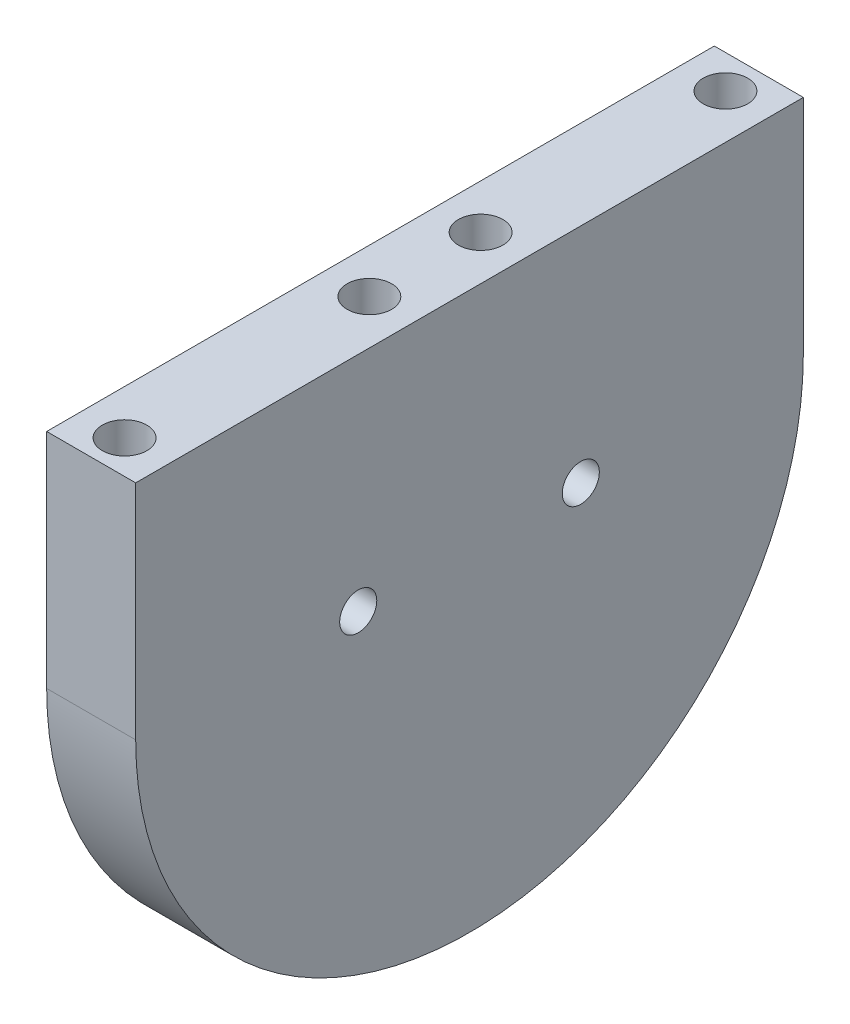
ISO-10303-21;
HEADER;
FILE_DESCRIPTION(('STEP AP214'),'2;1');
FILE_NAME('part.step','',(''),(''),'','','');
FILE_SCHEMA(('AUTOMOTIVE_DESIGN { 1 0 10303 214 1 1 1 1 }'));
ENDSEC;
DATA;
#1=APPLICATION_CONTEXT('core data for automotive mechanical design processes');
#2=APPLICATION_PROTOCOL_DEFINITION('international standard','automotive_design',2000,#1);
#3=PRODUCT_CONTEXT('',#1,'mechanical');
#4=PRODUCT('Part','Part','',(#3));
#5=PRODUCT_RELATED_PRODUCT_CATEGORY('part','',(#4));
#6=PRODUCT_DEFINITION_FORMATION('','',#4);
#7=PRODUCT_DEFINITION_CONTEXT('part definition',#1,'design');
#8=PRODUCT_DEFINITION('design','',#6,#7);
#9=PRODUCT_DEFINITION_SHAPE('','',#8);
#10=(LENGTH_UNIT() NAMED_UNIT(*) SI_UNIT(.MILLI.,.METRE.));
#11=(NAMED_UNIT(*) PLANE_ANGLE_UNIT() SI_UNIT($,.RADIAN.));
#12=(NAMED_UNIT(*) SI_UNIT($,.STERADIAN.) SOLID_ANGLE_UNIT());
#13=UNCERTAINTY_MEASURE_WITH_UNIT(LENGTH_MEASURE(1.E-05),#10,'distance_accuracy_value','');
#14=(GEOMETRIC_REPRESENTATION_CONTEXT(3) GLOBAL_UNCERTAINTY_ASSIGNED_CONTEXT((#13)) GLOBAL_UNIT_ASSIGNED_CONTEXT((#10,
#11,#12)) REPRESENTATION_CONTEXT('',''));
#15=CARTESIAN_POINT('',(0.,0.,0.));
#16=DIRECTION('',(0.,0.,1.));
#17=DIRECTION('',(1.,0.,0.));
#18=AXIS2_PLACEMENT_3D('',#15,#16,#17);
#19=CARTESIAN_POINT('',(12.,0.,0.));
#20=DIRECTION('',(1.,0.,0.));
#21=DIRECTION('',(0.,0.,-1.));
#22=AXIS2_PLACEMENT_3D('',#19,#20,#21);
#23=PLANE('',#22);
#24=CARTESIAN_POINT('',(12.,0.,15.));
#25=DIRECTION('',(1.,0.,0.));
#26=DIRECTION('',(0.,0.,-1.));
#27=AXIS2_PLACEMENT_3D('',#24,#25,#26);
#28=CIRCLE('',#27,2.5);
#29=CARTESIAN_POINT('',(12.,0.,12.5));
#30=VERTEX_POINT('',#29);
#31=EDGE_CURVE('E104',#30,#30,#28,.T.);
#32=ORIENTED_EDGE('',*,*,#31,.F.);
#33=EDGE_LOOP('',(#32));
#34=FACE_BOUND('',#33,.T.);
#35=CARTESIAN_POINT('',(12.,0.,0.));
#36=DIRECTION('',(1.,0.,0.));
#37=DIRECTION('',(0.,0.,-1.));
#38=AXIS2_PLACEMENT_3D('',#35,#36,#37);
#39=CIRCLE('',#38,45.);
#40=CARTESIAN_POINT('',(12.,0.,45.));
#41=VERTEX_POINT('',#40);
#42=CARTESIAN_POINT('',(12.,0.,-45.));
#43=VERTEX_POINT('',#42);
#44=EDGE_CURVE('E89',#41,#43,#39,.T.);
#45=ORIENTED_EDGE('',*,*,#44,.T.);
#46=DIRECTION('',(0.,1.,0.));
#47=VECTOR('',#46,1.);
#48=CARTESIAN_POINT('',(12.,0.,-45.));
#49=LINE('',#48,#47);
#50=CARTESIAN_POINT('',(12.,30.,-45.));
#51=VERTEX_POINT('',#50);
#52=EDGE_CURVE('E84',#43,#51,#49,.T.);
#53=ORIENTED_EDGE('',*,*,#52,.T.);
#54=DIRECTION('',(0.,0.,1.));
#55=VECTOR('',#54,1.);
#56=CARTESIAN_POINT('',(12.,30.,45.));
#57=LINE('',#56,#55);
#58=CARTESIAN_POINT('',(12.,30.,45.));
#59=VERTEX_POINT('',#58);
#60=EDGE_CURVE('E87',#51,#59,#57,.T.);
#61=ORIENTED_EDGE('',*,*,#60,.T.);
#62=DIRECTION('',(0.,-1.,0.));
#63=VECTOR('',#62,1.);
#64=CARTESIAN_POINT('',(12.,0.,45.));
#65=LINE('',#64,#63);
#66=EDGE_CURVE('E54',#59,#41,#65,.T.);
#67=ORIENTED_EDGE('',*,*,#66,.T.);
#68=EDGE_LOOP('',(#45,#53,#61,#67));
#69=FACE_BOUND('',#68,.T.);
#70=CARTESIAN_POINT('',(12.,0.,-15.));
#71=DIRECTION('',(1.,0.,0.));
#72=DIRECTION('',(0.,0.,-1.));
#73=AXIS2_PLACEMENT_3D('',#70,#71,#72);
#74=CIRCLE('',#73,2.5);
#75=CARTESIAN_POINT('',(12.,0.,-17.5));
#76=VERTEX_POINT('',#75);
#77=EDGE_CURVE('E119',#76,#76,#74,.T.);
#78=ORIENTED_EDGE('',*,*,#77,.F.);
#79=EDGE_LOOP('',(#78));
#80=FACE_BOUND('',#79,.T.);
#81=ADVANCED_FACE('F37',(#34,#69,#80),#23,.T.);
#82=CARTESIAN_POINT('',(0.,0.,0.));
#83=DIRECTION('',(1.,0.,0.));
#84=DIRECTION('',(0.,0.,-1.));
#85=AXIS2_PLACEMENT_3D('',#82,#83,#84);
#86=PLANE('',#85);
#87=CARTESIAN_POINT('',(0.,0.,0.));
#88=DIRECTION('',(1.,0.,0.));
#89=DIRECTION('',(0.,0.,-1.));
#90=AXIS2_PLACEMENT_3D('',#87,#88,#89);
#91=CIRCLE('',#90,45.);
#92=CARTESIAN_POINT('',(0.,0.,45.));
#93=VERTEX_POINT('',#92);
#94=CARTESIAN_POINT('',(0.,0.,-45.));
#95=VERTEX_POINT('',#94);
#96=EDGE_CURVE('E101',#93,#95,#91,.T.);
#97=ORIENTED_EDGE('',*,*,#96,.F.);
#98=DIRECTION('',(0.,-1.,0.));
#99=VECTOR('',#98,1.);
#100=CARTESIAN_POINT('',(0.,0.,45.));
#101=LINE('',#100,#99);
#102=CARTESIAN_POINT('',(0.,30.,45.));
#103=VERTEX_POINT('',#102);
#104=EDGE_CURVE('E77',#103,#93,#101,.T.);
#105=ORIENTED_EDGE('',*,*,#104,.F.);
#106=DIRECTION('',(0.,0.,1.));
#107=VECTOR('',#106,1.);
#108=CARTESIAN_POINT('',(0.,30.,45.));
#109=LINE('',#108,#107);
#110=CARTESIAN_POINT('',(0.,30.,-45.));
#111=VERTEX_POINT('',#110);
#112=EDGE_CURVE('E71',#111,#103,#109,.T.);
#113=ORIENTED_EDGE('',*,*,#112,.F.);
#114=DIRECTION('',(0.,1.,0.));
#115=VECTOR('',#114,1.);
#116=CARTESIAN_POINT('',(0.,0.,-45.));
#117=LINE('',#116,#115);
#118=EDGE_CURVE('E93',#95,#111,#117,.T.);
#119=ORIENTED_EDGE('',*,*,#118,.F.);
#120=EDGE_LOOP('',(#97,#105,#113,#119));
#121=FACE_BOUND('',#120,.T.);
#122=CARTESIAN_POINT('',(0.,0.,15.));
#123=DIRECTION('',(1.,0.,0.));
#124=DIRECTION('',(0.,0.,-1.));
#125=AXIS2_PLACEMENT_3D('',#122,#123,#124);
#126=CIRCLE('',#125,2.5);
#127=CARTESIAN_POINT('',(0.,0.,12.5));
#128=VERTEX_POINT('',#127);
#129=EDGE_CURVE('E116',#128,#128,#126,.T.);
#130=ORIENTED_EDGE('',*,*,#129,.T.);
#131=EDGE_LOOP('',(#130));
#132=FACE_BOUND('',#131,.T.);
#133=CARTESIAN_POINT('',(0.,0.,-15.));
#134=DIRECTION('',(1.,0.,0.));
#135=DIRECTION('',(0.,0.,-1.));
#136=AXIS2_PLACEMENT_3D('',#133,#134,#135);
#137=CIRCLE('',#136,2.5);
#138=CARTESIAN_POINT('',(0.,0.,-17.5));
#139=VERTEX_POINT('',#138);
#140=EDGE_CURVE('E122',#139,#139,#137,.T.);
#141=ORIENTED_EDGE('',*,*,#140,.T.);
#142=EDGE_LOOP('',(#141));
#143=FACE_BOUND('',#142,.T.);
#144=ADVANCED_FACE('F112',(#121,#132,#143),#86,.F.);
#145=CARTESIAN_POINT('',(12.,0.,0.));
#146=DIRECTION('',(-1.,0.,0.));
#147=DIRECTION('',(0.,0.,1.));
#148=AXIS2_PLACEMENT_3D('',#145,#146,#147);
#149=CYLINDRICAL_SURFACE('',#148,45.);
#150=ORIENTED_EDGE('',*,*,#96,.T.);
#151=DIRECTION('',(-1.,0.,0.));
#152=VECTOR('',#151,1.);
#153=CARTESIAN_POINT('',(12.,0.,-45.));
#154=LINE('',#153,#152);
#155=EDGE_CURVE('E11',#43,#95,#154,.T.);
#156=ORIENTED_EDGE('',*,*,#155,.F.);
#157=ORIENTED_EDGE('',*,*,#44,.F.);
#158=DIRECTION('',(-1.,0.,0.));
#159=VECTOR('',#158,1.);
#160=CARTESIAN_POINT('',(12.,0.,45.));
#161=LINE('',#160,#159);
#162=EDGE_CURVE('E97',#41,#93,#161,.T.);
#163=ORIENTED_EDGE('',*,*,#162,.T.);
#164=EDGE_LOOP('',(#150,#156,#157,#163));
#165=FACE_BOUND('',#164,.T.);
#166=ADVANCED_FACE('F39',(#165),#149,.T.);
#167=CARTESIAN_POINT('',(12.,0.,-45.));
#168=DIRECTION('',(0.,0.,1.));
#169=DIRECTION('',(0.,-1.,0.));
#170=AXIS2_PLACEMENT_3D('',#167,#168,#169);
#171=PLANE('',#170);
#172=ORIENTED_EDGE('',*,*,#118,.T.);
#173=DIRECTION('',(-1.,0.,0.));
#174=VECTOR('',#173,1.);
#175=CARTESIAN_POINT('',(12.,30.,-45.));
#176=LINE('',#175,#174);
#177=EDGE_CURVE('E46',#51,#111,#176,.T.);
#178=ORIENTED_EDGE('',*,*,#177,.F.);
#179=ORIENTED_EDGE('',*,*,#52,.F.);
#180=ORIENTED_EDGE('',*,*,#155,.T.);
#181=EDGE_LOOP('',(#172,#178,#179,#180));
#182=FACE_BOUND('',#181,.T.);
#183=ADVANCED_FACE('F92',(#182),#171,.F.);
#184=CARTESIAN_POINT('',(12.,30.,45.));
#185=DIRECTION('',(0.,-1.,0.));
#186=DIRECTION('',(0.,0.,-1.));
#187=AXIS2_PLACEMENT_3D('',#184,#185,#186);
#188=PLANE('',#187);
#189=CARTESIAN_POINT('',(5.99999999999998,30.,-40.5));
#190=DIRECTION('',(0.,1.,0.));
#191=DIRECTION('',(0.,0.,1.));
#192=AXIS2_PLACEMENT_3D('',#189,#190,#191);
#193=CIRCLE('',#192,3.);
#194=CARTESIAN_POINT('',(5.99999999999998,30.,-37.5));
#195=VERTEX_POINT('',#194);
#196=EDGE_CURVE('E146',#195,#195,#193,.T.);
#197=ORIENTED_EDGE('',*,*,#196,.F.);
#198=EDGE_LOOP('',(#197));
#199=FACE_BOUND('',#198,.T.);
#200=CARTESIAN_POINT('',(5.99999999999999,30.,-7.5));
#201=DIRECTION('',(0.,1.,0.));
#202=DIRECTION('',(0.,0.,1.));
#203=AXIS2_PLACEMENT_3D('',#200,#201,#202);
#204=CIRCLE('',#203,3.);
#205=CARTESIAN_POINT('',(5.99999999999999,30.,-4.5));
#206=VERTEX_POINT('',#205);
#207=EDGE_CURVE('E140',#206,#206,#204,.T.);
#208=ORIENTED_EDGE('',*,*,#207,.F.);
#209=EDGE_LOOP('',(#208));
#210=FACE_BOUND('',#209,.T.);
#211=CARTESIAN_POINT('',(5.99999999999999,30.,7.5));
#212=DIRECTION('',(0.,1.,0.));
#213=DIRECTION('',(0.,0.,1.));
#214=AXIS2_PLACEMENT_3D('',#211,#212,#213);
#215=CIRCLE('',#214,3.);
#216=CARTESIAN_POINT('',(5.99999999999999,30.,10.5));
#217=VERTEX_POINT('',#216);
#218=EDGE_CURVE('E134',#217,#217,#215,.T.);
#219=ORIENTED_EDGE('',*,*,#218,.F.);
#220=EDGE_LOOP('',(#219));
#221=FACE_BOUND('',#220,.T.);
#222=CARTESIAN_POINT('',(5.99999999999999,30.,40.5));
#223=DIRECTION('',(0.,1.,0.));
#224=DIRECTION('',(0.,0.,1.));
#225=AXIS2_PLACEMENT_3D('',#222,#223,#224);
#226=CIRCLE('',#225,3.);
#227=CARTESIAN_POINT('',(5.99999999999999,30.,43.5));
#228=VERTEX_POINT('',#227);
#229=EDGE_CURVE('E128',#228,#228,#226,.T.);
#230=ORIENTED_EDGE('',*,*,#229,.F.);
#231=EDGE_LOOP('',(#230));
#232=FACE_BOUND('',#231,.T.);
#233=ORIENTED_EDGE('',*,*,#112,.T.);
#234=DIRECTION('',(-1.,0.,0.));
#235=VECTOR('',#234,1.);
#236=CARTESIAN_POINT('',(12.,30.,45.));
#237=LINE('',#236,#235);
#238=EDGE_CURVE('E94',#59,#103,#237,.T.);
#239=ORIENTED_EDGE('',*,*,#238,.F.);
#240=ORIENTED_EDGE('',*,*,#60,.F.);
#241=ORIENTED_EDGE('',*,*,#177,.T.);
#242=EDGE_LOOP('',(#233,#239,#240,#241));
#243=FACE_BOUND('',#242,.T.);
#244=ADVANCED_FACE('F95',(#199,#210,#221,#232,#243),#188,.F.);
#245=CARTESIAN_POINT('',(12.,0.,45.));
#246=DIRECTION('',(0.,0.,-1.));
#247=DIRECTION('',(0.,1.,0.));
#248=AXIS2_PLACEMENT_3D('',#245,#246,#247);
#249=PLANE('',#248);
#250=ORIENTED_EDGE('',*,*,#104,.T.);
#251=ORIENTED_EDGE('',*,*,#162,.F.);
#252=ORIENTED_EDGE('',*,*,#66,.F.);
#253=ORIENTED_EDGE('',*,*,#238,.T.);
#254=EDGE_LOOP('',(#250,#251,#252,#253));
#255=FACE_BOUND('',#254,.T.);
#256=ADVANCED_FACE('F109',(#255),#249,.F.);
#257=CARTESIAN_POINT('',(12.,0.,15.));
#258=DIRECTION('',(-1.,0.,0.));
#259=DIRECTION('',(0.,0.,1.));
#260=AXIS2_PLACEMENT_3D('',#257,#258,#259);
#261=CYLINDRICAL_SURFACE('',#260,2.5);
#262=ORIENTED_EDGE('',*,*,#31,.T.);
#263=EDGE_LOOP('',(#262));
#264=FACE_BOUND('',#263,.T.);
#265=ORIENTED_EDGE('',*,*,#129,.F.);
#266=EDGE_LOOP('',(#265));
#267=FACE_BOUND('',#266,.T.);
#268=ADVANCED_FACE('F183',(#264,#267),#261,.F.);
#269=CARTESIAN_POINT('',(12.,0.,-15.));
#270=DIRECTION('',(-1.,0.,0.));
#271=DIRECTION('',(0.,0.,1.));
#272=AXIS2_PLACEMENT_3D('',#269,#270,#271);
#273=CYLINDRICAL_SURFACE('',#272,2.5);
#274=ORIENTED_EDGE('',*,*,#77,.T.);
#275=EDGE_LOOP('',(#274));
#276=FACE_BOUND('',#275,.T.);
#277=ORIENTED_EDGE('',*,*,#140,.F.);
#278=EDGE_LOOP('',(#277));
#279=FACE_BOUND('',#278,.T.);
#280=ADVANCED_FACE('F173',(#276,#279),#273,.F.);
#281=CARTESIAN_POINT('',(5.99999999999999,5.,40.5));
#282=DIRECTION('',(0.,1.,0.));
#283=DIRECTION('',(0.,0.,1.));
#284=AXIS2_PLACEMENT_3D('',#281,#282,#283);
#285=CYLINDRICAL_SURFACE('',#284,3.);
#286=CARTESIAN_POINT('',(5.99999999999999,5.,40.5));
#287=DIRECTION('',(0.,1.,0.));
#288=DIRECTION('',(0.,0.,1.));
#289=AXIS2_PLACEMENT_3D('',#286,#287,#288);
#290=CIRCLE('',#289,3.);
#291=CARTESIAN_POINT('',(5.99999999999999,5.,43.5));
#292=VERTEX_POINT('',#291);
#293=EDGE_CURVE('E131',#292,#292,#290,.T.);
#294=ORIENTED_EDGE('',*,*,#293,.F.);
#295=EDGE_LOOP('',(#294));
#296=FACE_BOUND('',#295,.T.);
#297=ORIENTED_EDGE('',*,*,#229,.T.);
#298=EDGE_LOOP('',(#297));
#299=FACE_BOUND('',#298,.T.);
#300=ADVANCED_FACE('F170',(#296,#299),#285,.F.);
#301=CARTESIAN_POINT('',(5.99999999999999,5.,40.5));
#302=DIRECTION('',(0.,1.,0.));
#303=DIRECTION('',(0.,0.,1.));
#304=AXIS2_PLACEMENT_3D('',#301,#302,#303);
#305=PLANE('',#304);
#306=ORIENTED_EDGE('',*,*,#293,.T.);
#307=EDGE_LOOP('',(#306));
#308=FACE_BOUND('',#307,.T.);
#309=ADVANCED_FACE('F172',(#308),#305,.T.);
#310=CARTESIAN_POINT('',(5.99999999999999,5.,7.5));
#311=DIRECTION('',(0.,1.,0.));
#312=DIRECTION('',(0.,0.,1.));
#313=AXIS2_PLACEMENT_3D('',#310,#311,#312);
#314=CYLINDRICAL_SURFACE('',#313,3.);
#315=CARTESIAN_POINT('',(5.99999999999999,5.,7.5));
#316=DIRECTION('',(0.,1.,0.));
#317=DIRECTION('',(0.,0.,1.));
#318=AXIS2_PLACEMENT_3D('',#315,#316,#317);
#319=CIRCLE('',#318,3.);
#320=CARTESIAN_POINT('',(5.99999999999999,5.,10.5));
#321=VERTEX_POINT('',#320);
#322=EDGE_CURVE('E137',#321,#321,#319,.T.);
#323=ORIENTED_EDGE('',*,*,#322,.F.);
#324=EDGE_LOOP('',(#323));
#325=FACE_BOUND('',#324,.T.);
#326=ORIENTED_EDGE('',*,*,#218,.T.);
#327=EDGE_LOOP('',(#326));
#328=FACE_BOUND('',#327,.T.);
#329=ADVANCED_FACE('F180',(#325,#328),#314,.F.);
#330=CARTESIAN_POINT('',(5.99999999999999,5.,7.5));
#331=DIRECTION('',(0.,1.,0.));
#332=DIRECTION('',(0.,0.,1.));
#333=AXIS2_PLACEMENT_3D('',#330,#331,#332);
#334=PLANE('',#333);
#335=ORIENTED_EDGE('',*,*,#322,.T.);
#336=EDGE_LOOP('',(#335));
#337=FACE_BOUND('',#336,.T.);
#338=ADVANCED_FACE('F259',(#337),#334,.T.);
#339=CARTESIAN_POINT('',(5.99999999999999,5.,-7.5));
#340=DIRECTION('',(0.,1.,0.));
#341=DIRECTION('',(0.,0.,1.));
#342=AXIS2_PLACEMENT_3D('',#339,#340,#341);
#343=CYLINDRICAL_SURFACE('',#342,3.);
#344=CARTESIAN_POINT('',(5.99999999999999,5.,-7.5));
#345=DIRECTION('',(0.,1.,0.));
#346=DIRECTION('',(0.,0.,1.));
#347=AXIS2_PLACEMENT_3D('',#344,#345,#346);
#348=CIRCLE('',#347,3.);
#349=CARTESIAN_POINT('',(5.99999999999999,5.,-4.5));
#350=VERTEX_POINT('',#349);
#351=EDGE_CURVE('E143',#350,#350,#348,.T.);
#352=ORIENTED_EDGE('',*,*,#351,.F.);
#353=EDGE_LOOP('',(#352));
#354=FACE_BOUND('',#353,.T.);
#355=ORIENTED_EDGE('',*,*,#207,.T.);
#356=EDGE_LOOP('',(#355));
#357=FACE_BOUND('',#356,.T.);
#358=ADVANCED_FACE('F268',(#354,#357),#343,.F.);
#359=CARTESIAN_POINT('',(5.99999999999999,5.,-7.5));
#360=DIRECTION('',(0.,1.,0.));
#361=DIRECTION('',(0.,0.,1.));
#362=AXIS2_PLACEMENT_3D('',#359,#360,#361);
#363=PLANE('',#362);
#364=ORIENTED_EDGE('',*,*,#351,.T.);
#365=EDGE_LOOP('',(#364));
#366=FACE_BOUND('',#365,.T.);
#367=ADVANCED_FACE('F157',(#366),#363,.T.);
#368=CARTESIAN_POINT('',(5.99999999999998,5.,-40.5));
#369=DIRECTION('',(0.,1.,0.));
#370=DIRECTION('',(0.,0.,1.));
#371=AXIS2_PLACEMENT_3D('',#368,#369,#370);
#372=CYLINDRICAL_SURFACE('',#371,3.);
#373=CARTESIAN_POINT('',(5.99999999999998,5.,-40.5));
#374=DIRECTION('',(0.,1.,0.));
#375=DIRECTION('',(0.,0.,1.));
#376=AXIS2_PLACEMENT_3D('',#373,#374,#375);
#377=CIRCLE('',#376,3.);
#378=CARTESIAN_POINT('',(5.99999999999998,5.,-37.5));
#379=VERTEX_POINT('',#378);
#380=EDGE_CURVE('E125',#379,#379,#377,.T.);
#381=ORIENTED_EDGE('',*,*,#380,.F.);
#382=EDGE_LOOP('',(#381));
#383=FACE_BOUND('',#382,.T.);
#384=ORIENTED_EDGE('',*,*,#196,.T.);
#385=EDGE_LOOP('',(#384));
#386=FACE_BOUND('',#385,.T.);
#387=ADVANCED_FACE('F154',(#383,#386),#372,.F.);
#388=CARTESIAN_POINT('',(5.99999999999998,5.,-40.5));
#389=DIRECTION('',(0.,1.,0.));
#390=DIRECTION('',(0.,0.,1.));
#391=AXIS2_PLACEMENT_3D('',#388,#389,#390);
#392=PLANE('',#391);
#393=ORIENTED_EDGE('',*,*,#380,.T.);
#394=EDGE_LOOP('',(#393));
#395=FACE_BOUND('',#394,.T.);
#396=ADVANCED_FACE('F152',(#395),#392,.T.);
#397=CLOSED_SHELL('',(#81,#144,#166,#183,#244,#256,#268,#280,#300,#309,#329,#338,#358,#367,#387,#396));
#398=MANIFOLD_SOLID_BREP('B2',#397);
#399=ADVANCED_BREP_SHAPE_REPRESENTATION('',(#18,#398),#14);
#400=SHAPE_DEFINITION_REPRESENTATION(#9,#399);
ENDSEC;
END-ISO-10303-21;
